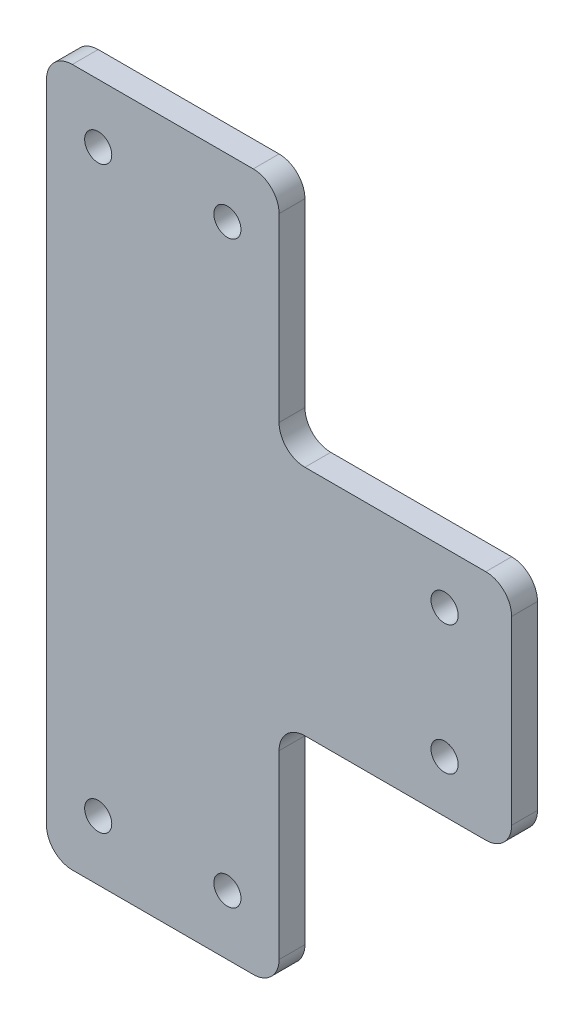
ISO-10303-21;
HEADER;
FILE_DESCRIPTION(('STEP AP214'),'2;1');
FILE_NAME('part.step','',(''),(''),'','','');
FILE_SCHEMA(('AUTOMOTIVE_DESIGN { 1 0 10303 214 1 1 1 1 }'));
ENDSEC;
DATA;
#1=APPLICATION_CONTEXT('core data for automotive mechanical design processes');
#2=APPLICATION_PROTOCOL_DEFINITION('international standard','automotive_design',2000,#1);
#3=PRODUCT_CONTEXT('',#1,'mechanical');
#4=PRODUCT('Part','Part','',(#3));
#5=PRODUCT_RELATED_PRODUCT_CATEGORY('part','',(#4));
#6=PRODUCT_DEFINITION_FORMATION('','',#4);
#7=PRODUCT_DEFINITION_CONTEXT('part definition',#1,'design');
#8=PRODUCT_DEFINITION('design','',#6,#7);
#9=PRODUCT_DEFINITION_SHAPE('','',#8);
#10=(LENGTH_UNIT() NAMED_UNIT(*) SI_UNIT(.MILLI.,.METRE.));
#11=(NAMED_UNIT(*) PLANE_ANGLE_UNIT() SI_UNIT($,.RADIAN.));
#12=(NAMED_UNIT(*) SI_UNIT($,.STERADIAN.) SOLID_ANGLE_UNIT());
#13=UNCERTAINTY_MEASURE_WITH_UNIT(LENGTH_MEASURE(1.E-05),#10,'distance_accuracy_value','');
#14=(GEOMETRIC_REPRESENTATION_CONTEXT(3) GLOBAL_UNCERTAINTY_ASSIGNED_CONTEXT((#13)) GLOBAL_UNIT_ASSIGNED_CONTEXT((#10,
#11,#12)) REPRESENTATION_CONTEXT('',''));
#15=CARTESIAN_POINT('',(0.,0.,0.));
#16=DIRECTION('',(0.,0.,1.));
#17=DIRECTION('',(1.,0.,0.));
#18=AXIS2_PLACEMENT_3D('',#15,#16,#17);
#19=CARTESIAN_POINT('',(-36.,54.,4.));
#20=DIRECTION('',(1.,0.,0.));
#21=DIRECTION('',(0.,1.,0.));
#22=AXIS2_PLACEMENT_3D('',#19,#20,#21);
#23=PLANE('',#22);
#24=DIRECTION('',(0.,-1.,0.));
#25=VECTOR('',#24,1.);
#26=CARTESIAN_POINT('',(-36.,54.,0.));
#27=LINE('',#26,#25);
#28=CARTESIAN_POINT('',(-36.,50.,0.));
#29=VERTEX_POINT('',#28);
#30=CARTESIAN_POINT('',(-36.,-50.,0.));
#31=VERTEX_POINT('',#30);
#32=EDGE_CURVE('E175',#29,#31,#27,.T.);
#33=ORIENTED_EDGE('',*,*,#32,.T.);
#34=DIRECTION('',(0.,0.,-1.));
#35=VECTOR('',#34,1.);
#36=CARTESIAN_POINT('',(-36.,-50.,4.));
#37=LINE('',#36,#35);
#38=CARTESIAN_POINT('',(-36.,-50.,4.));
#39=VERTEX_POINT('',#38);
#40=EDGE_CURVE('E153',#31,#39,#37,.F.);
#41=ORIENTED_EDGE('',*,*,#40,.T.);
#42=DIRECTION('',(0.,-1.,0.));
#43=VECTOR('',#42,1.);
#44=CARTESIAN_POINT('',(-36.,54.,4.));
#45=LINE('',#44,#43);
#46=CARTESIAN_POINT('',(-36.,50.,4.));
#47=VERTEX_POINT('',#46);
#48=EDGE_CURVE('E197',#47,#39,#45,.T.);
#49=ORIENTED_EDGE('',*,*,#48,.F.);
#50=DIRECTION('',(0.,0.,-1.));
#51=VECTOR('',#50,1.);
#52=CARTESIAN_POINT('',(-36.,50.,4.));
#53=LINE('',#52,#51);
#54=EDGE_CURVE('E158',#47,#29,#53,.T.);
#55=ORIENTED_EDGE('',*,*,#54,.T.);
#56=EDGE_LOOP('',(#33,#41,#49,#55));
#57=FACE_BOUND('',#56,.T.);
#58=ADVANCED_FACE('F34',(#57),#23,.F.);
#59=CARTESIAN_POINT('',(-36.,-54.,4.));
#60=DIRECTION('',(0.,1.,0.));
#61=DIRECTION('',(0.,0.,1.));
#62=AXIS2_PLACEMENT_3D('',#59,#60,#61);
#63=PLANE('',#62);
#64=DIRECTION('',(1.,0.,0.));
#65=VECTOR('',#64,1.);
#66=CARTESIAN_POINT('',(-36.,-54.,4.));
#67=LINE('',#66,#65);
#68=CARTESIAN_POINT('',(-32.,-54.,4.));
#69=VERTEX_POINT('',#68);
#70=CARTESIAN_POINT('',(-4.,-54.,4.));
#71=VERTEX_POINT('',#70);
#72=EDGE_CURVE('E168',#69,#71,#67,.T.);
#73=ORIENTED_EDGE('',*,*,#72,.F.);
#74=DIRECTION('',(0.,0.,-1.));
#75=VECTOR('',#74,1.);
#76=CARTESIAN_POINT('',(-32.,-54.,4.));
#77=LINE('',#76,#75);
#78=CARTESIAN_POINT('',(-32.,-54.,0.));
#79=VERTEX_POINT('',#78);
#80=EDGE_CURVE('E152',#69,#79,#77,.T.);
#81=ORIENTED_EDGE('',*,*,#80,.T.);
#82=DIRECTION('',(1.,0.,0.));
#83=VECTOR('',#82,1.);
#84=CARTESIAN_POINT('',(-36.,-54.,0.));
#85=LINE('',#84,#83);
#86=CARTESIAN_POINT('',(-4.,-54.,0.));
#87=VERTEX_POINT('',#86);
#88=EDGE_CURVE('E165',#79,#87,#85,.T.);
#89=ORIENTED_EDGE('',*,*,#88,.T.);
#90=DIRECTION('',(0.,0.,-1.));
#91=VECTOR('',#90,1.);
#92=CARTESIAN_POINT('',(-4.,-54.,4.));
#93=LINE('',#92,#91);
#94=EDGE_CURVE('E170',#87,#71,#93,.F.);
#95=ORIENTED_EDGE('',*,*,#94,.T.);
#96=EDGE_LOOP('',(#73,#81,#89,#95));
#97=FACE_BOUND('',#96,.T.);
#98=ADVANCED_FACE('F164',(#97),#63,.F.);
#99=CARTESIAN_POINT('',(0.,-18.,4.));
#100=DIRECTION('',(-1.,0.,0.));
#101=DIRECTION('',(0.,-1.,0.));
#102=AXIS2_PLACEMENT_3D('',#99,#100,#101);
#103=PLANE('',#102);
#104=DIRECTION('',(0.,1.,0.));
#105=VECTOR('',#104,1.);
#106=CARTESIAN_POINT('',(0.,-18.,4.));
#107=LINE('',#106,#105);
#108=CARTESIAN_POINT('',(0.,-50.,4.));
#109=VERTEX_POINT('',#108);
#110=CARTESIAN_POINT('',(0.,-22.,4.));
#111=VERTEX_POINT('',#110);
#112=EDGE_CURVE('E283',#109,#111,#107,.T.);
#113=ORIENTED_EDGE('',*,*,#112,.F.);
#114=DIRECTION('',(0.,0.,-1.));
#115=VECTOR('',#114,1.);
#116=CARTESIAN_POINT('',(0.,-50.,4.));
#117=LINE('',#116,#115);
#118=CARTESIAN_POINT('',(0.,-50.,0.));
#119=VERTEX_POINT('',#118);
#120=EDGE_CURVE('E224',#109,#119,#117,.T.);
#121=ORIENTED_EDGE('',*,*,#120,.T.);
#122=DIRECTION('',(0.,1.,0.));
#123=VECTOR('',#122,1.);
#124=CARTESIAN_POINT('',(0.,-18.,0.));
#125=LINE('',#124,#123);
#126=CARTESIAN_POINT('',(0.,-22.,0.));
#127=VERTEX_POINT('',#126);
#128=EDGE_CURVE('E174',#119,#127,#125,.T.);
#129=ORIENTED_EDGE('',*,*,#128,.T.);
#130=DIRECTION('',(0.,0.,-1.));
#131=VECTOR('',#130,1.);
#132=CARTESIAN_POINT('',(0.,-22.,4.));
#133=LINE('',#132,#131);
#134=EDGE_CURVE('E222',#127,#111,#133,.F.);
#135=ORIENTED_EDGE('',*,*,#134,.T.);
#136=EDGE_LOOP('',(#113,#121,#129,#135));
#137=FACE_BOUND('',#136,.T.);
#138=ADVANCED_FACE('F361',(#137),#103,.F.);
#139=CARTESIAN_POINT('',(0.,-18.,4.));
#140=DIRECTION('',(0.,1.,0.));
#141=DIRECTION('',(0.,0.,1.));
#142=AXIS2_PLACEMENT_3D('',#139,#140,#141);
#143=PLANE('',#142);
#144=DIRECTION('',(1.,0.,0.));
#145=VECTOR('',#144,1.);
#146=CARTESIAN_POINT('',(0.,-18.,4.));
#147=LINE('',#146,#145);
#148=CARTESIAN_POINT('',(3.99999999999999,-18.,4.));
#149=VERTEX_POINT('',#148);
#150=CARTESIAN_POINT('',(32.,-18.,4.));
#151=VERTEX_POINT('',#150);
#152=EDGE_CURVE('E280',#149,#151,#147,.T.);
#153=ORIENTED_EDGE('',*,*,#152,.F.);
#154=DIRECTION('',(0.,0.,-1.));
#155=VECTOR('',#154,1.);
#156=CARTESIAN_POINT('',(3.99999999999999,-18.,0.));
#157=LINE('',#156,#155);
#158=CARTESIAN_POINT('',(3.99999999999999,-18.,0.));
#159=VERTEX_POINT('',#158);
#160=EDGE_CURVE('E229',#149,#159,#157,.T.);
#161=ORIENTED_EDGE('',*,*,#160,.T.);
#162=DIRECTION('',(1.,0.,0.));
#163=VECTOR('',#162,1.);
#164=CARTESIAN_POINT('',(0.,-18.,0.));
#165=LINE('',#164,#163);
#166=CARTESIAN_POINT('',(32.,-18.,0.));
#167=VERTEX_POINT('',#166);
#168=EDGE_CURVE('E178',#159,#167,#165,.T.);
#169=ORIENTED_EDGE('',*,*,#168,.T.);
#170=DIRECTION('',(0.,0.,-1.));
#171=VECTOR('',#170,1.);
#172=CARTESIAN_POINT('',(32.,-18.,4.));
#173=LINE('',#172,#171);
#174=EDGE_CURVE('E227',#167,#151,#173,.F.);
#175=ORIENTED_EDGE('',*,*,#174,.T.);
#176=EDGE_LOOP('',(#153,#161,#169,#175));
#177=FACE_BOUND('',#176,.T.);
#178=ADVANCED_FACE('F406',(#177),#143,.F.);
#179=CARTESIAN_POINT('',(36.,18.,4.));
#180=DIRECTION('',(-1.,0.,0.));
#181=DIRECTION('',(0.,0.,1.));
#182=AXIS2_PLACEMENT_3D('',#179,#180,#181);
#183=PLANE('',#182);
#184=DIRECTION('',(0.,1.,0.));
#185=VECTOR('',#184,1.);
#186=CARTESIAN_POINT('',(36.,18.,4.));
#187=LINE('',#186,#185);
#188=CARTESIAN_POINT('',(36.,-14.,4.));
#189=VERTEX_POINT('',#188);
#190=CARTESIAN_POINT('',(36.,14.,4.));
#191=VERTEX_POINT('',#190);
#192=EDGE_CURVE('E275',#189,#191,#187,.T.);
#193=ORIENTED_EDGE('',*,*,#192,.F.);
#194=DIRECTION('',(0.,0.,-1.));
#195=VECTOR('',#194,1.);
#196=CARTESIAN_POINT('',(36.,-14.,4.));
#197=LINE('',#196,#195);
#198=CARTESIAN_POINT('',(36.,-14.,0.));
#199=VERTEX_POINT('',#198);
#200=EDGE_CURVE('E234',#189,#199,#197,.T.);
#201=ORIENTED_EDGE('',*,*,#200,.T.);
#202=DIRECTION('',(0.,1.,0.));
#203=VECTOR('',#202,1.);
#204=CARTESIAN_POINT('',(36.,18.,0.));
#205=LINE('',#204,#203);
#206=CARTESIAN_POINT('',(36.,14.,0.));
#207=VERTEX_POINT('',#206);
#208=EDGE_CURVE('E186',#199,#207,#205,.T.);
#209=ORIENTED_EDGE('',*,*,#208,.T.);
#210=DIRECTION('',(0.,0.,-1.));
#211=VECTOR('',#210,1.);
#212=CARTESIAN_POINT('',(36.,14.,4.));
#213=LINE('',#212,#211);
#214=EDGE_CURVE('E232',#207,#191,#213,.F.);
#215=ORIENTED_EDGE('',*,*,#214,.T.);
#216=EDGE_LOOP('',(#193,#201,#209,#215));
#217=FACE_BOUND('',#216,.T.);
#218=ADVANCED_FACE('F413',(#217),#183,.F.);
#219=CARTESIAN_POINT('',(0.,18.,4.));
#220=DIRECTION('',(0.,-1.,0.));
#221=DIRECTION('',(0.,0.,-1.));
#222=AXIS2_PLACEMENT_3D('',#219,#220,#221);
#223=PLANE('',#222);
#224=DIRECTION('',(-1.,0.,0.));
#225=VECTOR('',#224,1.);
#226=CARTESIAN_POINT('',(0.,18.,4.));
#227=LINE('',#226,#225);
#228=CARTESIAN_POINT('',(32.,18.,4.));
#229=VERTEX_POINT('',#228);
#230=CARTESIAN_POINT('',(3.99999999999999,18.,4.));
#231=VERTEX_POINT('',#230);
#232=EDGE_CURVE('E270',#229,#231,#227,.T.);
#233=ORIENTED_EDGE('',*,*,#232,.F.);
#234=DIRECTION('',(0.,0.,-1.));
#235=VECTOR('',#234,1.);
#236=CARTESIAN_POINT('',(32.,18.,4.));
#237=LINE('',#236,#235);
#238=CARTESIAN_POINT('',(32.,18.,0.));
#239=VERTEX_POINT('',#238);
#240=EDGE_CURVE('E239',#229,#239,#237,.T.);
#241=ORIENTED_EDGE('',*,*,#240,.T.);
#242=DIRECTION('',(-1.,0.,0.));
#243=VECTOR('',#242,1.);
#244=CARTESIAN_POINT('',(0.,18.,0.));
#245=LINE('',#244,#243);
#246=CARTESIAN_POINT('',(3.99999999999999,18.,0.));
#247=VERTEX_POINT('',#246);
#248=EDGE_CURVE('E189',#239,#247,#245,.T.);
#249=ORIENTED_EDGE('',*,*,#248,.T.);
#250=DIRECTION('',(0.,0.,-1.));
#251=VECTOR('',#250,1.);
#252=CARTESIAN_POINT('',(3.99999999999999,18.,4.));
#253=LINE('',#252,#251);
#254=EDGE_CURVE('E237',#247,#231,#253,.F.);
#255=ORIENTED_EDGE('',*,*,#254,.T.);
#256=EDGE_LOOP('',(#233,#241,#249,#255));
#257=FACE_BOUND('',#256,.T.);
#258=ADVANCED_FACE('F261',(#257),#223,.F.);
#259=CARTESIAN_POINT('',(0.,54.,4.));
#260=DIRECTION('',(-1.,0.,0.));
#261=DIRECTION('',(0.,-1.,0.));
#262=AXIS2_PLACEMENT_3D('',#259,#260,#261);
#263=PLANE('',#262);
#264=DIRECTION('',(0.,1.,0.));
#265=VECTOR('',#264,1.);
#266=CARTESIAN_POINT('',(0.,54.,4.));
#267=LINE('',#266,#265);
#268=CARTESIAN_POINT('',(0.,22.,4.));
#269=VERTEX_POINT('',#268);
#270=CARTESIAN_POINT('',(0.,50.,4.));
#271=VERTEX_POINT('',#270);
#272=EDGE_CURVE('E269',#269,#271,#267,.T.);
#273=ORIENTED_EDGE('',*,*,#272,.F.);
#274=DIRECTION('',(0.,0.,-1.));
#275=VECTOR('',#274,1.);
#276=CARTESIAN_POINT('',(0.,22.,0.));
#277=LINE('',#276,#275);
#278=CARTESIAN_POINT('',(0.,22.,0.));
#279=VERTEX_POINT('',#278);
#280=EDGE_CURVE('E244',#269,#279,#277,.T.);
#281=ORIENTED_EDGE('',*,*,#280,.T.);
#282=DIRECTION('',(0.,1.,0.));
#283=VECTOR('',#282,1.);
#284=CARTESIAN_POINT('',(0.,54.,0.));
#285=LINE('',#284,#283);
#286=CARTESIAN_POINT('',(0.,50.,0.));
#287=VERTEX_POINT('',#286);
#288=EDGE_CURVE('E192',#279,#287,#285,.T.);
#289=ORIENTED_EDGE('',*,*,#288,.T.);
#290=DIRECTION('',(0.,0.,-1.));
#291=VECTOR('',#290,1.);
#292=CARTESIAN_POINT('',(0.,50.,4.));
#293=LINE('',#292,#291);
#294=EDGE_CURVE('E242',#287,#271,#293,.F.);
#295=ORIENTED_EDGE('',*,*,#294,.T.);
#296=EDGE_LOOP('',(#273,#281,#289,#295));
#297=FACE_BOUND('',#296,.T.);
#298=ADVANCED_FACE('F272',(#297),#263,.F.);
#299=CARTESIAN_POINT('',(-36.,54.,4.));
#300=DIRECTION('',(0.,-1.,0.));
#301=DIRECTION('',(0.,0.,-1.));
#302=AXIS2_PLACEMENT_3D('',#299,#300,#301);
#303=PLANE('',#302);
#304=DIRECTION('',(-1.,0.,0.));
#305=VECTOR('',#304,1.);
#306=CARTESIAN_POINT('',(-36.,54.,4.));
#307=LINE('',#306,#305);
#308=CARTESIAN_POINT('',(-4.,54.,4.));
#309=VERTEX_POINT('',#308);
#310=CARTESIAN_POINT('',(-32.,54.,4.));
#311=VERTEX_POINT('',#310);
#312=EDGE_CURVE('E198',#309,#311,#307,.T.);
#313=ORIENTED_EDGE('',*,*,#312,.F.);
#314=DIRECTION('',(0.,0.,-1.));
#315=VECTOR('',#314,1.);
#316=CARTESIAN_POINT('',(-4.,54.,4.));
#317=LINE('',#316,#315);
#318=CARTESIAN_POINT('',(-4.,54.,0.));
#319=VERTEX_POINT('',#318);
#320=EDGE_CURVE('E248',#309,#319,#317,.T.);
#321=ORIENTED_EDGE('',*,*,#320,.T.);
#322=DIRECTION('',(-1.,0.,0.));
#323=VECTOR('',#322,1.);
#324=CARTESIAN_POINT('',(-36.,54.,0.));
#325=LINE('',#324,#323);
#326=CARTESIAN_POINT('',(-32.,54.,0.));
#327=VERTEX_POINT('',#326);
#328=EDGE_CURVE('E195',#319,#327,#325,.T.);
#329=ORIENTED_EDGE('',*,*,#328,.T.);
#330=DIRECTION('',(0.,0.,-1.));
#331=VECTOR('',#330,1.);
#332=CARTESIAN_POINT('',(-32.,54.,4.));
#333=LINE('',#332,#331);
#334=EDGE_CURVE('E49',#327,#311,#333,.F.);
#335=ORIENTED_EDGE('',*,*,#334,.T.);
#336=EDGE_LOOP('',(#313,#321,#329,#335));
#337=FACE_BOUND('',#336,.T.);
#338=ADVANCED_FACE('F328',(#337),#303,.F.);
#339=CARTESIAN_POINT('',(0.,0.,4.));
#340=DIRECTION('',(0.,0.,1.));
#341=DIRECTION('',(1.,0.,0.));
#342=AXIS2_PLACEMENT_3D('',#339,#340,#341);
#343=PLANE('',#342);
#344=CARTESIAN_POINT('',(-28.,44.9124104095091,4.));
#345=DIRECTION('',(0.,0.,1.));
#346=DIRECTION('',(1.,0.,0.));
#347=AXIS2_PLACEMENT_3D('',#344,#345,#346);
#348=CIRCLE('',#347,2.09999999999999);
#349=CARTESIAN_POINT('',(-25.9,44.9124104095091,4.));
#350=VERTEX_POINT('',#349);
#351=EDGE_CURVE('E320',#350,#350,#348,.T.);
#352=ORIENTED_EDGE('',*,*,#351,.F.);
#353=EDGE_LOOP('',(#352));
#354=FACE_BOUND('',#353,.T.);
#355=CARTESIAN_POINT('',(-8.00000000000001,44.9124104095091,4.));
#356=DIRECTION('',(0.,0.,1.));
#357=DIRECTION('',(1.,0.,0.));
#358=AXIS2_PLACEMENT_3D('',#355,#356,#357);
#359=CIRCLE('',#358,2.09999999999999);
#360=CARTESIAN_POINT('',(-5.90000000000002,44.9124104095091,4.));
#361=VERTEX_POINT('',#360);
#362=EDGE_CURVE('E314',#361,#361,#359,.T.);
#363=ORIENTED_EDGE('',*,*,#362,.F.);
#364=EDGE_LOOP('',(#363));
#365=FACE_BOUND('',#364,.T.);
#366=CARTESIAN_POINT('',(25.6168276341668,10.,4.));
#367=DIRECTION('',(0.,0.,1.));
#368=DIRECTION('',(1.,0.,0.));
#369=AXIS2_PLACEMENT_3D('',#366,#367,#368);
#370=CIRCLE('',#369,2.09999999999999);
#371=CARTESIAN_POINT('',(27.7168276341668,10.,4.));
#372=VERTEX_POINT('',#371);
#373=EDGE_CURVE('E308',#372,#372,#370,.T.);
#374=ORIENTED_EDGE('',*,*,#373,.F.);
#375=EDGE_LOOP('',(#374));
#376=FACE_BOUND('',#375,.T.);
#377=CARTESIAN_POINT('',(25.6168276341668,-10.,4.));
#378=DIRECTION('',(0.,0.,1.));
#379=DIRECTION('',(1.,0.,0.));
#380=AXIS2_PLACEMENT_3D('',#377,#378,#379);
#381=CIRCLE('',#380,2.09999999999999);
#382=CARTESIAN_POINT('',(27.7168276341668,-10.,4.));
#383=VERTEX_POINT('',#382);
#384=EDGE_CURVE('E302',#383,#383,#381,.T.);
#385=ORIENTED_EDGE('',*,*,#384,.F.);
#386=EDGE_LOOP('',(#385));
#387=FACE_BOUND('',#386,.T.);
#388=CARTESIAN_POINT('',(-28.,-44.7580241979129,4.));
#389=DIRECTION('',(0.,0.,1.));
#390=DIRECTION('',(1.,0.,0.));
#391=AXIS2_PLACEMENT_3D('',#388,#389,#390);
#392=CIRCLE('',#391,2.09999999999999);
#393=CARTESIAN_POINT('',(-25.9,-44.7580241979129,4.));
#394=VERTEX_POINT('',#393);
#395=EDGE_CURVE('E296',#394,#394,#392,.T.);
#396=ORIENTED_EDGE('',*,*,#395,.F.);
#397=EDGE_LOOP('',(#396));
#398=FACE_BOUND('',#397,.T.);
#399=CARTESIAN_POINT('',(-7.99999999999999,-44.7580241979129,4.));
#400=DIRECTION('',(0.,0.,1.));
#401=DIRECTION('',(1.,0.,0.));
#402=AXIS2_PLACEMENT_3D('',#399,#400,#401);
#403=CIRCLE('',#402,2.09999999999999);
#404=CARTESIAN_POINT('',(-5.90000000000001,-44.7580241979129,4.));
#405=VERTEX_POINT('',#404);
#406=EDGE_CURVE('E290',#405,#405,#403,.T.);
#407=ORIENTED_EDGE('',*,*,#406,.F.);
#408=EDGE_LOOP('',(#407));
#409=FACE_BOUND('',#408,.T.);
#410=ORIENTED_EDGE('',*,*,#48,.T.);
#411=CARTESIAN_POINT('',(-32.,-50.,4.));
#412=DIRECTION('',(0.,0.,1.));
#413=DIRECTION('',(1.,0.,0.));
#414=AXIS2_PLACEMENT_3D('',#411,#412,#413);
#415=CIRCLE('',#414,4.);
#416=EDGE_CURVE('E220',#39,#69,#415,.T.);
#417=ORIENTED_EDGE('',*,*,#416,.T.);
#418=ORIENTED_EDGE('',*,*,#72,.T.);
#419=CARTESIAN_POINT('',(-4.00000000000001,-50.,4.));
#420=DIRECTION('',(0.,0.,1.));
#421=DIRECTION('',(1.,0.,0.));
#422=AXIS2_PLACEMENT_3D('',#419,#420,#421);
#423=CIRCLE('',#422,4.);
#424=EDGE_CURVE('E218',#71,#109,#423,.T.);
#425=ORIENTED_EDGE('',*,*,#424,.T.);
#426=ORIENTED_EDGE('',*,*,#112,.T.);
#427=CARTESIAN_POINT('',(3.99999999999999,-22.,4.));
#428=DIRECTION('',(0.,0.,1.));
#429=DIRECTION('',(1.,0.,0.));
#430=AXIS2_PLACEMENT_3D('',#427,#428,#429);
#431=CIRCLE('',#430,4.);
#432=EDGE_CURVE('E253',#111,#149,#431,.F.);
#433=ORIENTED_EDGE('',*,*,#432,.T.);
#434=ORIENTED_EDGE('',*,*,#152,.T.);
#435=CARTESIAN_POINT('',(32.,-14.,4.));
#436=DIRECTION('',(0.,0.,1.));
#437=DIRECTION('',(1.,0.,0.));
#438=AXIS2_PLACEMENT_3D('',#435,#436,#437);
#439=CIRCLE('',#438,4.);
#440=EDGE_CURVE('E216',#151,#189,#439,.T.);
#441=ORIENTED_EDGE('',*,*,#440,.T.);
#442=ORIENTED_EDGE('',*,*,#192,.T.);
#443=CARTESIAN_POINT('',(32.,14.,4.));
#444=DIRECTION('',(0.,0.,1.));
#445=DIRECTION('',(1.,0.,0.));
#446=AXIS2_PLACEMENT_3D('',#443,#444,#445);
#447=CIRCLE('',#446,4.);
#448=EDGE_CURVE('E214',#191,#229,#447,.T.);
#449=ORIENTED_EDGE('',*,*,#448,.T.);
#450=ORIENTED_EDGE('',*,*,#232,.T.);
#451=CARTESIAN_POINT('',(3.99999999999999,22.,4.));
#452=DIRECTION('',(0.,0.,1.));
#453=DIRECTION('',(1.,0.,0.));
#454=AXIS2_PLACEMENT_3D('',#451,#452,#453);
#455=CIRCLE('',#454,4.);
#456=EDGE_CURVE('E11',#231,#269,#455,.F.);
#457=ORIENTED_EDGE('',*,*,#456,.T.);
#458=ORIENTED_EDGE('',*,*,#272,.T.);
#459=CARTESIAN_POINT('',(-4.,50.,4.));
#460=DIRECTION('',(0.,0.,1.));
#461=DIRECTION('',(1.,0.,0.));
#462=AXIS2_PLACEMENT_3D('',#459,#460,#461);
#463=CIRCLE('',#462,4.);
#464=EDGE_CURVE('E56',#271,#309,#463,.T.);
#465=ORIENTED_EDGE('',*,*,#464,.T.);
#466=ORIENTED_EDGE('',*,*,#312,.T.);
#467=CARTESIAN_POINT('',(-32.,50.,4.));
#468=DIRECTION('',(0.,0.,1.));
#469=DIRECTION('',(1.,0.,0.));
#470=AXIS2_PLACEMENT_3D('',#467,#468,#469);
#471=CIRCLE('',#470,4.);
#472=EDGE_CURVE('E211',#311,#47,#471,.T.);
#473=ORIENTED_EDGE('',*,*,#472,.T.);
#474=EDGE_LOOP('',(#410,#417,#418,#425,#426,#433,#434,#441,#442,#449,#450,#457,#458,#465,#466,#473));
#475=FACE_BOUND('',#474,.T.);
#476=ADVANCED_FACE('F268',(#354,#365,#376,#387,#398,#409,#475),#343,.T.);
#477=CARTESIAN_POINT('',(0.,0.,0.));
#478=DIRECTION('',(0.,0.,1.));
#479=DIRECTION('',(1.,0.,0.));
#480=AXIS2_PLACEMENT_3D('',#477,#478,#479);
#481=PLANE('',#480);
#482=CARTESIAN_POINT('',(-28.,44.9124104095091,0.));
#483=DIRECTION('',(0.,0.,1.));
#484=DIRECTION('',(1.,0.,0.));
#485=AXIS2_PLACEMENT_3D('',#482,#483,#484);
#486=CIRCLE('',#485,2.1);
#487=CARTESIAN_POINT('',(-25.9,44.9124104095091,0.));
#488=VERTEX_POINT('',#487);
#489=EDGE_CURVE('E317',#488,#488,#486,.T.);
#490=ORIENTED_EDGE('',*,*,#489,.T.);
#491=EDGE_LOOP('',(#490));
#492=FACE_BOUND('',#491,.T.);
#493=CARTESIAN_POINT('',(-8.00000000000001,44.9124104095091,0.));
#494=DIRECTION('',(0.,0.,1.));
#495=DIRECTION('',(1.,0.,0.));
#496=AXIS2_PLACEMENT_3D('',#493,#494,#495);
#497=CIRCLE('',#496,2.1);
#498=CARTESIAN_POINT('',(-5.90000000000001,44.9124104095091,0.));
#499=VERTEX_POINT('',#498);
#500=EDGE_CURVE('E311',#499,#499,#497,.T.);
#501=ORIENTED_EDGE('',*,*,#500,.T.);
#502=EDGE_LOOP('',(#501));
#503=FACE_BOUND('',#502,.T.);
#504=CARTESIAN_POINT('',(25.6168276341668,10.,0.));
#505=DIRECTION('',(0.,0.,1.));
#506=DIRECTION('',(1.,0.,0.));
#507=AXIS2_PLACEMENT_3D('',#504,#505,#506);
#508=CIRCLE('',#507,2.1);
#509=CARTESIAN_POINT('',(27.7168276341668,10.,0.));
#510=VERTEX_POINT('',#509);
#511=EDGE_CURVE('E305',#510,#510,#508,.T.);
#512=ORIENTED_EDGE('',*,*,#511,.T.);
#513=EDGE_LOOP('',(#512));
#514=FACE_BOUND('',#513,.T.);
#515=CARTESIAN_POINT('',(25.6168276341668,-10.,0.));
#516=DIRECTION('',(0.,0.,1.));
#517=DIRECTION('',(1.,0.,0.));
#518=AXIS2_PLACEMENT_3D('',#515,#516,#517);
#519=CIRCLE('',#518,2.1);
#520=CARTESIAN_POINT('',(27.7168276341668,-10.,0.));
#521=VERTEX_POINT('',#520);
#522=EDGE_CURVE('E299',#521,#521,#519,.T.);
#523=ORIENTED_EDGE('',*,*,#522,.T.);
#524=EDGE_LOOP('',(#523));
#525=FACE_BOUND('',#524,.T.);
#526=CARTESIAN_POINT('',(-28.,-44.7580241979129,0.));
#527=DIRECTION('',(0.,0.,1.));
#528=DIRECTION('',(1.,0.,0.));
#529=AXIS2_PLACEMENT_3D('',#526,#527,#528);
#530=CIRCLE('',#529,2.1);
#531=CARTESIAN_POINT('',(-25.9,-44.7580241979129,0.));
#532=VERTEX_POINT('',#531);
#533=EDGE_CURVE('E293',#532,#532,#530,.T.);
#534=ORIENTED_EDGE('',*,*,#533,.T.);
#535=EDGE_LOOP('',(#534));
#536=FACE_BOUND('',#535,.T.);
#537=CARTESIAN_POINT('',(-7.99999999999999,-44.7580241979129,0.));
#538=DIRECTION('',(0.,0.,1.));
#539=DIRECTION('',(1.,0.,0.));
#540=AXIS2_PLACEMENT_3D('',#537,#538,#539);
#541=CIRCLE('',#540,2.1);
#542=CARTESIAN_POINT('',(-5.9,-44.7580241979129,0.));
#543=VERTEX_POINT('',#542);
#544=EDGE_CURVE('E180',#543,#543,#541,.T.);
#545=ORIENTED_EDGE('',*,*,#544,.T.);
#546=EDGE_LOOP('',(#545));
#547=FACE_BOUND('',#546,.T.);
#548=ORIENTED_EDGE('',*,*,#88,.F.);
#549=CARTESIAN_POINT('',(-32.,-50.,0.));
#550=DIRECTION('',(0.,0.,1.));
#551=DIRECTION('',(1.,0.,0.));
#552=AXIS2_PLACEMENT_3D('',#549,#550,#551);
#553=CIRCLE('',#552,4.);
#554=EDGE_CURVE('E148',#79,#31,#553,.F.);
#555=ORIENTED_EDGE('',*,*,#554,.T.);
#556=ORIENTED_EDGE('',*,*,#32,.F.);
#557=CARTESIAN_POINT('',(-32.,50.,0.));
#558=DIRECTION('',(0.,0.,1.));
#559=DIRECTION('',(1.,0.,0.));
#560=AXIS2_PLACEMENT_3D('',#557,#558,#559);
#561=CIRCLE('',#560,4.);
#562=EDGE_CURVE('E169',#29,#327,#561,.F.);
#563=ORIENTED_EDGE('',*,*,#562,.T.);
#564=ORIENTED_EDGE('',*,*,#328,.F.);
#565=CARTESIAN_POINT('',(-4.,50.,0.));
#566=DIRECTION('',(0.,0.,1.));
#567=DIRECTION('',(1.,0.,0.));
#568=AXIS2_PLACEMENT_3D('',#565,#566,#567);
#569=CIRCLE('',#568,4.);
#570=EDGE_CURVE('E201',#319,#287,#569,.F.);
#571=ORIENTED_EDGE('',*,*,#570,.T.);
#572=ORIENTED_EDGE('',*,*,#288,.F.);
#573=CARTESIAN_POINT('',(3.99999999999999,22.,0.));
#574=DIRECTION('',(0.,0.,1.));
#575=DIRECTION('',(1.,0.,0.));
#576=AXIS2_PLACEMENT_3D('',#573,#574,#575);
#577=CIRCLE('',#576,4.);
#578=EDGE_CURVE('E42',#279,#247,#577,.T.);
#579=ORIENTED_EDGE('',*,*,#578,.T.);
#580=ORIENTED_EDGE('',*,*,#248,.F.);
#581=CARTESIAN_POINT('',(32.,14.,0.));
#582=DIRECTION('',(0.,0.,1.));
#583=DIRECTION('',(1.,0.,0.));
#584=AXIS2_PLACEMENT_3D('',#581,#582,#583);
#585=CIRCLE('',#584,4.);
#586=EDGE_CURVE('E203',#239,#207,#585,.F.);
#587=ORIENTED_EDGE('',*,*,#586,.T.);
#588=ORIENTED_EDGE('',*,*,#208,.F.);
#589=CARTESIAN_POINT('',(32.,-14.,0.));
#590=DIRECTION('',(0.,0.,1.));
#591=DIRECTION('',(1.,0.,0.));
#592=AXIS2_PLACEMENT_3D('',#589,#590,#591);
#593=CIRCLE('',#592,4.);
#594=EDGE_CURVE('E205',#199,#167,#593,.F.);
#595=ORIENTED_EDGE('',*,*,#594,.T.);
#596=ORIENTED_EDGE('',*,*,#168,.F.);
#597=CARTESIAN_POINT('',(3.99999999999999,-22.,0.));
#598=DIRECTION('',(0.,0.,1.));
#599=DIRECTION('',(1.,0.,0.));
#600=AXIS2_PLACEMENT_3D('',#597,#598,#599);
#601=CIRCLE('',#600,4.);
#602=EDGE_CURVE('E251',#159,#127,#601,.T.);
#603=ORIENTED_EDGE('',*,*,#602,.T.);
#604=ORIENTED_EDGE('',*,*,#128,.F.);
#605=CARTESIAN_POINT('',(-4.00000000000001,-50.,0.));
#606=DIRECTION('',(0.,0.,1.));
#607=DIRECTION('',(1.,0.,0.));
#608=AXIS2_PLACEMENT_3D('',#605,#606,#607);
#609=CIRCLE('',#608,4.);
#610=EDGE_CURVE('E159',#119,#87,#609,.F.);
#611=ORIENTED_EDGE('',*,*,#610,.T.);
#612=EDGE_LOOP('',(#548,#555,#556,#563,#564,#571,#572,#579,#580,#587,#588,#595,#596,#603,#604,#611));
#613=FACE_BOUND('',#612,.T.);
#614=ADVANCED_FACE('F172',(#492,#503,#514,#525,#536,#547,#613),#481,.F.);
#615=CARTESIAN_POINT('',(-7.99999999999999,-44.7580241979129,4.));
#616=DIRECTION('',(0.,0.,1.));
#617=DIRECTION('',(1.,0.,0.));
#618=AXIS2_PLACEMENT_3D('',#615,#616,#617);
#619=CYLINDRICAL_SURFACE('',#618,2.09999999999999);
#620=ORIENTED_EDGE('',*,*,#544,.F.);
#621=EDGE_LOOP('',(#620));
#622=FACE_BOUND('',#621,.T.);
#623=ORIENTED_EDGE('',*,*,#406,.T.);
#624=EDGE_LOOP('',(#623));
#625=FACE_BOUND('',#624,.T.);
#626=ADVANCED_FACE('F340',(#622,#625),#619,.F.);
#627=CARTESIAN_POINT('',(-28.,-44.7580241979129,4.));
#628=DIRECTION('',(0.,0.,1.));
#629=DIRECTION('',(1.,0.,0.));
#630=AXIS2_PLACEMENT_3D('',#627,#628,#629);
#631=CYLINDRICAL_SURFACE('',#630,2.09999999999999);
#632=ORIENTED_EDGE('',*,*,#533,.F.);
#633=EDGE_LOOP('',(#632));
#634=FACE_BOUND('',#633,.T.);
#635=ORIENTED_EDGE('',*,*,#395,.T.);
#636=EDGE_LOOP('',(#635));
#637=FACE_BOUND('',#636,.T.);
#638=ADVANCED_FACE('F342',(#634,#637),#631,.F.);
#639=CARTESIAN_POINT('',(25.6168276341668,-10.,4.));
#640=DIRECTION('',(0.,0.,1.));
#641=DIRECTION('',(1.,0.,0.));
#642=AXIS2_PLACEMENT_3D('',#639,#640,#641);
#643=CYLINDRICAL_SURFACE('',#642,2.09999999999999);
#644=ORIENTED_EDGE('',*,*,#522,.F.);
#645=EDGE_LOOP('',(#644));
#646=FACE_BOUND('',#645,.T.);
#647=ORIENTED_EDGE('',*,*,#384,.T.);
#648=EDGE_LOOP('',(#647));
#649=FACE_BOUND('',#648,.T.);
#650=ADVANCED_FACE('F349',(#646,#649),#643,.F.);
#651=CARTESIAN_POINT('',(25.6168276341668,10.,4.));
#652=DIRECTION('',(0.,0.,1.));
#653=DIRECTION('',(1.,0.,0.));
#654=AXIS2_PLACEMENT_3D('',#651,#652,#653);
#655=CYLINDRICAL_SURFACE('',#654,2.09999999999999);
#656=ORIENTED_EDGE('',*,*,#511,.F.);
#657=EDGE_LOOP('',(#656));
#658=FACE_BOUND('',#657,.T.);
#659=ORIENTED_EDGE('',*,*,#373,.T.);
#660=EDGE_LOOP('',(#659));
#661=FACE_BOUND('',#660,.T.);
#662=ADVANCED_FACE('F535',(#658,#661),#655,.F.);
#663=CARTESIAN_POINT('',(-8.00000000000001,44.9124104095091,4.));
#664=DIRECTION('',(0.,0.,1.));
#665=DIRECTION('',(1.,0.,0.));
#666=AXIS2_PLACEMENT_3D('',#663,#664,#665);
#667=CYLINDRICAL_SURFACE('',#666,2.09999999999999);
#668=ORIENTED_EDGE('',*,*,#500,.F.);
#669=EDGE_LOOP('',(#668));
#670=FACE_BOUND('',#669,.T.);
#671=ORIENTED_EDGE('',*,*,#362,.T.);
#672=EDGE_LOOP('',(#671));
#673=FACE_BOUND('',#672,.T.);
#674=ADVANCED_FACE('F527',(#670,#673),#667,.F.);
#675=CARTESIAN_POINT('',(-28.,44.9124104095091,4.));
#676=DIRECTION('',(0.,0.,1.));
#677=DIRECTION('',(1.,0.,0.));
#678=AXIS2_PLACEMENT_3D('',#675,#676,#677);
#679=CYLINDRICAL_SURFACE('',#678,2.09999999999999);
#680=ORIENTED_EDGE('',*,*,#489,.F.);
#681=EDGE_LOOP('',(#680));
#682=FACE_BOUND('',#681,.T.);
#683=ORIENTED_EDGE('',*,*,#351,.T.);
#684=EDGE_LOOP('',(#683));
#685=FACE_BOUND('',#684,.T.);
#686=ADVANCED_FACE('F324',(#682,#685),#679,.F.);
#687=CARTESIAN_POINT('',(-32.,-50.,4.));
#688=DIRECTION('',(0.,0.,-1.));
#689=DIRECTION('',(-1.,0.,0.));
#690=AXIS2_PLACEMENT_3D('',#687,#688,#689);
#691=CYLINDRICAL_SURFACE('',#690,4.);
#692=ORIENTED_EDGE('',*,*,#416,.F.);
#693=ORIENTED_EDGE('',*,*,#40,.F.);
#694=ORIENTED_EDGE('',*,*,#554,.F.);
#695=ORIENTED_EDGE('',*,*,#80,.F.);
#696=EDGE_LOOP('',(#692,#693,#694,#695));
#697=FACE_BOUND('',#696,.T.);
#698=ADVANCED_FACE('F151',(#697),#691,.T.);
#699=CARTESIAN_POINT('',(-4.00000000000001,-50.,4.));
#700=DIRECTION('',(0.,0.,-1.));
#701=DIRECTION('',(-1.,0.,0.));
#702=AXIS2_PLACEMENT_3D('',#699,#700,#701);
#703=CYLINDRICAL_SURFACE('',#702,4.);
#704=ORIENTED_EDGE('',*,*,#424,.F.);
#705=ORIENTED_EDGE('',*,*,#94,.F.);
#706=ORIENTED_EDGE('',*,*,#610,.F.);
#707=ORIENTED_EDGE('',*,*,#120,.F.);
#708=EDGE_LOOP('',(#704,#705,#706,#707));
#709=FACE_BOUND('',#708,.T.);
#710=ADVANCED_FACE('F367',(#709),#703,.T.);
#711=CARTESIAN_POINT('',(3.99999999999999,-22.,4.));
#712=DIRECTION('',(0.,0.,1.));
#713=DIRECTION('',(1.,0.,0.));
#714=AXIS2_PLACEMENT_3D('',#711,#712,#713);
#715=CYLINDRICAL_SURFACE('',#714,4.);
#716=ORIENTED_EDGE('',*,*,#432,.F.);
#717=ORIENTED_EDGE('',*,*,#134,.F.);
#718=ORIENTED_EDGE('',*,*,#602,.F.);
#719=ORIENTED_EDGE('',*,*,#160,.F.);
#720=EDGE_LOOP('',(#716,#717,#718,#719));
#721=FACE_BOUND('',#720,.T.);
#722=ADVANCED_FACE('F370',(#721),#715,.F.);
#723=CARTESIAN_POINT('',(32.,-14.,4.));
#724=DIRECTION('',(0.,0.,-1.));
#725=DIRECTION('',(-1.,0.,0.));
#726=AXIS2_PLACEMENT_3D('',#723,#724,#725);
#727=CYLINDRICAL_SURFACE('',#726,4.);
#728=ORIENTED_EDGE('',*,*,#440,.F.);
#729=ORIENTED_EDGE('',*,*,#174,.F.);
#730=ORIENTED_EDGE('',*,*,#594,.F.);
#731=ORIENTED_EDGE('',*,*,#200,.F.);
#732=EDGE_LOOP('',(#728,#729,#730,#731));
#733=FACE_BOUND('',#732,.T.);
#734=ADVANCED_FACE('F374',(#733),#727,.T.);
#735=CARTESIAN_POINT('',(32.,14.,4.));
#736=DIRECTION('',(0.,0.,-1.));
#737=DIRECTION('',(-1.,0.,0.));
#738=AXIS2_PLACEMENT_3D('',#735,#736,#737);
#739=CYLINDRICAL_SURFACE('',#738,4.);
#740=ORIENTED_EDGE('',*,*,#448,.F.);
#741=ORIENTED_EDGE('',*,*,#214,.F.);
#742=ORIENTED_EDGE('',*,*,#586,.F.);
#743=ORIENTED_EDGE('',*,*,#240,.F.);
#744=EDGE_LOOP('',(#740,#741,#742,#743));
#745=FACE_BOUND('',#744,.T.);
#746=ADVANCED_FACE('F378',(#745),#739,.T.);
#747=CARTESIAN_POINT('',(3.99999999999999,22.,4.));
#748=DIRECTION('',(0.,0.,1.));
#749=DIRECTION('',(1.,0.,0.));
#750=AXIS2_PLACEMENT_3D('',#747,#748,#749);
#751=CYLINDRICAL_SURFACE('',#750,4.);
#752=ORIENTED_EDGE('',*,*,#456,.F.);
#753=ORIENTED_EDGE('',*,*,#254,.F.);
#754=ORIENTED_EDGE('',*,*,#578,.F.);
#755=ORIENTED_EDGE('',*,*,#280,.F.);
#756=EDGE_LOOP('',(#752,#753,#754,#755));
#757=FACE_BOUND('',#756,.T.);
#758=ADVANCED_FACE('F265',(#757),#751,.F.);
#759=CARTESIAN_POINT('',(-4.,50.,4.));
#760=DIRECTION('',(0.,0.,-1.));
#761=DIRECTION('',(-1.,0.,0.));
#762=AXIS2_PLACEMENT_3D('',#759,#760,#761);
#763=CYLINDRICAL_SURFACE('',#762,4.);
#764=ORIENTED_EDGE('',*,*,#464,.F.);
#765=ORIENTED_EDGE('',*,*,#294,.F.);
#766=ORIENTED_EDGE('',*,*,#570,.F.);
#767=ORIENTED_EDGE('',*,*,#320,.F.);
#768=EDGE_LOOP('',(#764,#765,#766,#767));
#769=FACE_BOUND('',#768,.T.);
#770=ADVANCED_FACE('F384',(#769),#763,.T.);
#771=CARTESIAN_POINT('',(-32.,50.,4.));
#772=DIRECTION('',(0.,0.,-1.));
#773=DIRECTION('',(-1.,0.,0.));
#774=AXIS2_PLACEMENT_3D('',#771,#772,#773);
#775=CYLINDRICAL_SURFACE('',#774,4.);
#776=ORIENTED_EDGE('',*,*,#472,.F.);
#777=ORIENTED_EDGE('',*,*,#334,.F.);
#778=ORIENTED_EDGE('',*,*,#562,.F.);
#779=ORIENTED_EDGE('',*,*,#54,.F.);
#780=EDGE_LOOP('',(#776,#777,#778,#779));
#781=FACE_BOUND('',#780,.T.);
#782=ADVANCED_FACE('F36',(#781),#775,.T.);
#783=CLOSED_SHELL('',(#58,#98,#138,#178,#218,#258,#298,#338,#476,#614,#626,#638,#650,#662,#674,
#686,#698,#710,#722,#734,#746,#758,#770,#782));
#784=MANIFOLD_SOLID_BREP('B2',#783);
#785=ADVANCED_BREP_SHAPE_REPRESENTATION('',(#18,#784),#14);
#786=SHAPE_DEFINITION_REPRESENTATION(#9,#785);
ENDSEC;
END-ISO-10303-21;
